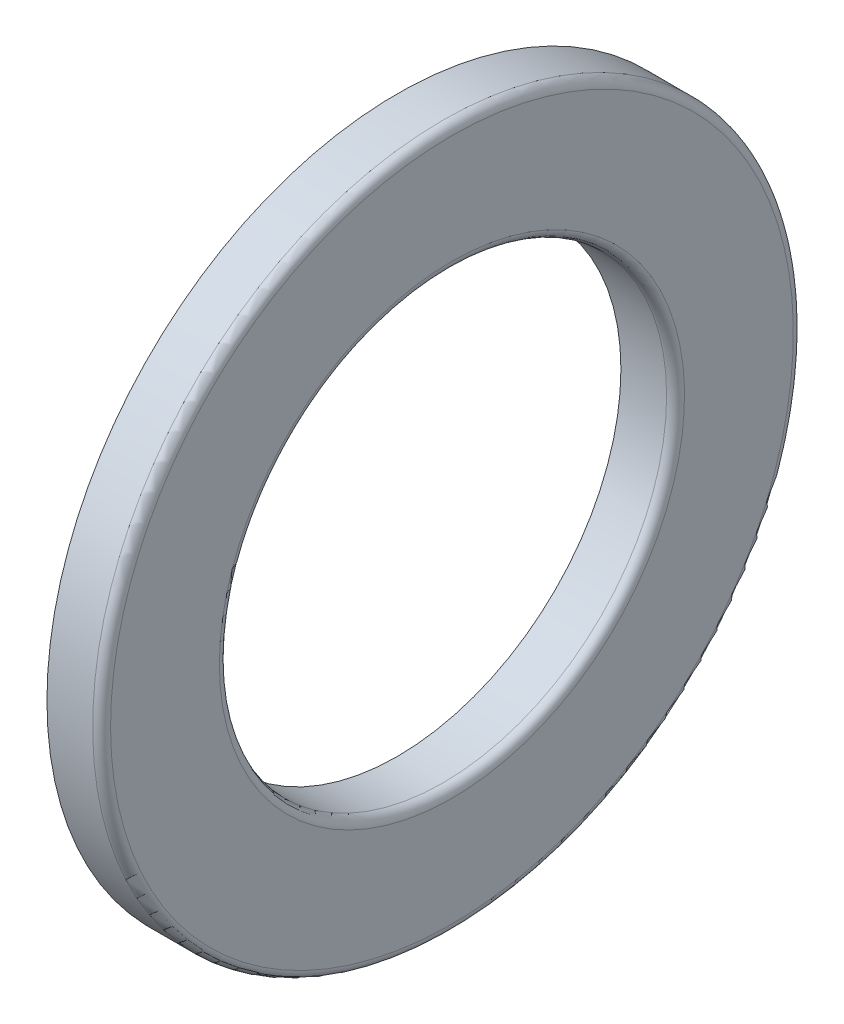
ISO-10303-21;
HEADER;
FILE_DESCRIPTION(('STEP AP214'),'2;1');
FILE_NAME('part.step','',(''),(''),'','','');
FILE_SCHEMA(('AUTOMOTIVE_DESIGN { 1 0 10303 214 1 1 1 1 }'));
ENDSEC;
DATA;
#1=APPLICATION_CONTEXT('core data for automotive mechanical design processes');
#2=APPLICATION_PROTOCOL_DEFINITION('international standard','automotive_design',2000,#1);
#3=PRODUCT_CONTEXT('',#1,'mechanical');
#4=PRODUCT('Part','Part','',(#3));
#5=PRODUCT_RELATED_PRODUCT_CATEGORY('part','',(#4));
#6=PRODUCT_DEFINITION_FORMATION('','',#4);
#7=PRODUCT_DEFINITION_CONTEXT('part definition',#1,'design');
#8=PRODUCT_DEFINITION('design','',#6,#7);
#9=PRODUCT_DEFINITION_SHAPE('','',#8);
#10=(LENGTH_UNIT() NAMED_UNIT(*) SI_UNIT(.MILLI.,.METRE.));
#11=(NAMED_UNIT(*) PLANE_ANGLE_UNIT() SI_UNIT($,.RADIAN.));
#12=(NAMED_UNIT(*) SI_UNIT($,.STERADIAN.) SOLID_ANGLE_UNIT());
#13=UNCERTAINTY_MEASURE_WITH_UNIT(LENGTH_MEASURE(1.E-05),#10,'distance_accuracy_value','');
#14=(GEOMETRIC_REPRESENTATION_CONTEXT(3) GLOBAL_UNCERTAINTY_ASSIGNED_CONTEXT((#13)) GLOBAL_UNIT_ASSIGNED_CONTEXT((#10,
#11,#12)) REPRESENTATION_CONTEXT('',''));
#15=CARTESIAN_POINT('',(0.,0.,0.));
#16=DIRECTION('',(0.,0.,1.));
#17=DIRECTION('',(1.,0.,0.));
#18=AXIS2_PLACEMENT_3D('',#15,#16,#17);
#19=CARTESIAN_POINT('',(5.5,0.,0.));
#20=DIRECTION('',(1.,0.,0.));
#21=DIRECTION('',(0.,1.,0.));
#22=AXIS2_PLACEMENT_3D('',#19,#20,#21);
#23=TOROIDAL_SURFACE('',#22,19.75,2.2);
#24=CARTESIAN_POINT('',(7.33333333333333,0.,0.));
#25=DIRECTION('',(1.,0.,0.));
#26=DIRECTION('',(0.,0.,-1.));
#27=AXIS2_PLACEMENT_3D('',#24,#25,#26);
#28=CIRCLE('',#27,18.5339042435364);
#29=CARTESIAN_POINT('',(7.33333333333333,0.,-18.5339042435364));
#30=VERTEX_POINT('',#29);
#31=EDGE_CURVE('E18',#30,#30,#28,.F.);
#32=ORIENTED_EDGE('',*,*,#31,.F.);
#33=EDGE_LOOP('',(#32));
#34=FACE_BOUND('',#33,.T.);
#35=CARTESIAN_POINT('',(7.33333333333333,0.,0.));
#36=DIRECTION('',(1.,0.,0.));
#37=DIRECTION('',(0.,0.,-1.));
#38=AXIS2_PLACEMENT_3D('',#35,#36,#37);
#39=CIRCLE('',#38,20.9660957564636);
#40=CARTESIAN_POINT('',(7.33333333333333,0.,-20.9660957564636));
#41=VERTEX_POINT('',#40);
#42=EDGE_CURVE('E52',#41,#41,#39,.T.);
#43=ORIENTED_EDGE('',*,*,#42,.F.);
#44=EDGE_LOOP('',(#43));
#45=FACE_BOUND('',#44,.T.);
#46=ADVANCED_FACE('F14',(#34,#45),#23,.F.);
#47=CARTESIAN_POINT('',(7.33333333333333,0.,19.25));
#48=DIRECTION('',(-1.,0.,0.));
#49=DIRECTION('',(0.,0.,1.));
#50=AXIS2_PLACEMENT_3D('',#47,#48,#49);
#51=PLANE('',#50);
#52=CARTESIAN_POINT('',(7.33333333333333,0.,0.));
#53=DIRECTION('',(1.,0.,0.));
#54=DIRECTION('',(0.,0.,-1.));
#55=AXIS2_PLACEMENT_3D('',#52,#53,#54);
#56=CIRCLE('',#55,15.00000000005);
#57=CARTESIAN_POINT('',(7.33333333333333,0.,-15.00000000005));
#58=VERTEX_POINT('',#57);
#59=EDGE_CURVE('E50',#58,#58,#56,.F.);
#60=ORIENTED_EDGE('',*,*,#59,.F.);
#61=EDGE_LOOP('',(#60));
#62=FACE_BOUND('',#61,.T.);
#63=ORIENTED_EDGE('',*,*,#31,.T.);
#64=EDGE_LOOP('',(#63));
#65=FACE_BOUND('',#64,.T.);
#66=ADVANCED_FACE('F59',(#62,#65),#51,.T.);
#67=CARTESIAN_POINT('',(7.33333333333333,0.,19.25));
#68=DIRECTION('',(-1.,0.,0.));
#69=DIRECTION('',(0.,0.,1.));
#70=AXIS2_PLACEMENT_3D('',#67,#68,#69);
#71=PLANE('',#70);
#72=CARTESIAN_POINT('',(7.33333333333333,0.,0.));
#73=DIRECTION('',(1.,0.,0.));
#74=DIRECTION('',(0.,0.,-1.));
#75=AXIS2_PLACEMENT_3D('',#72,#73,#74);
#76=CIRCLE('',#75,23.5);
#77=CARTESIAN_POINT('',(7.33333333333333,0.,-23.5));
#78=VERTEX_POINT('',#77);
#79=EDGE_CURVE('E37',#78,#78,#76,.T.);
#80=ORIENTED_EDGE('',*,*,#79,.F.);
#81=EDGE_LOOP('',(#80));
#82=FACE_BOUND('',#81,.T.);
#83=ORIENTED_EDGE('',*,*,#42,.T.);
#84=EDGE_LOOP('',(#83));
#85=FACE_BOUND('',#84,.T.);
#86=ADVANCED_FACE('F67',(#82,#85),#71,.T.);
#87=CARTESIAN_POINT('',(7.33333333333333,0.,0.));
#88=DIRECTION('',(1.,0.,0.));
#89=DIRECTION('',(0.,0.,-1.));
#90=AXIS2_PLACEMENT_3D('',#87,#88,#89);
#91=CYLINDRICAL_SURFACE('',#90,15.00000000005);
#92=ORIENTED_EDGE('',*,*,#59,.T.);
#93=EDGE_LOOP('',(#92));
#94=FACE_BOUND('',#93,.T.);
#95=CARTESIAN_POINT('',(10.4,0.,0.));
#96=DIRECTION('',(1.,0.,0.));
#97=DIRECTION('',(0.,1.,0.));
#98=AXIS2_PLACEMENT_3D('',#95,#96,#97);
#99=CIRCLE('',#98,15.0000000001);
#100=CARTESIAN_POINT('',(10.4,15.0000000001,0.));
#101=VERTEX_POINT('',#100);
#102=EDGE_CURVE('E32',#101,#101,#99,.F.);
#103=ORIENTED_EDGE('',*,*,#102,.F.);
#104=EDGE_LOOP('',(#103));
#105=FACE_BOUND('',#104,.T.);
#106=ADVANCED_FACE('F113',(#94,#105),#91,.F.);
#107=CARTESIAN_POINT('',(8.86666666666667,0.,0.));
#108=DIRECTION('',(1.,0.,0.));
#109=DIRECTION('',(0.,0.,-1.));
#110=AXIS2_PLACEMENT_3D('',#107,#108,#109);
#111=CYLINDRICAL_SURFACE('',#110,23.5);
#112=CARTESIAN_POINT('',(10.3999999997293,0.,0.));
#113=DIRECTION('',(1.,0.,0.));
#114=DIRECTION('',(0.,1.,0.));
#115=AXIS2_PLACEMENT_3D('',#112,#113,#114);
#116=CIRCLE('',#115,23.5);
#117=CARTESIAN_POINT('',(10.3999999997293,23.5,0.));
#118=VERTEX_POINT('',#117);
#119=EDGE_CURVE('E27',#118,#118,#116,.T.);
#120=ORIENTED_EDGE('',*,*,#119,.F.);
#121=EDGE_LOOP('',(#120));
#122=FACE_BOUND('',#121,.T.);
#123=ORIENTED_EDGE('',*,*,#79,.T.);
#124=EDGE_LOOP('',(#123));
#125=FACE_BOUND('',#124,.T.);
#126=ADVANCED_FACE('F109',(#122,#125),#111,.T.);
#127=CARTESIAN_POINT('',(10.3999999998293,0.,0.));
#128=DIRECTION('',(1.,0.,0.));
#129=DIRECTION('',(0.,1.,0.));
#130=AXIS2_PLACEMENT_3D('',#127,#128,#129);
#131=TOROIDAL_SURFACE('',#130,15.6000000002707,0.600000000170715);
#132=CARTESIAN_POINT('',(11.,0.,0.));
#133=DIRECTION('',(1.,0.,0.));
#134=DIRECTION('',(0.,0.,1.));
#135=AXIS2_PLACEMENT_3D('',#132,#133,#134);
#136=CIRCLE('',#135,15.6);
#137=CARTESIAN_POINT('',(11.,0.,15.6));
#138=VERTEX_POINT('',#137);
#139=EDGE_CURVE('E22',#138,#138,#136,.F.);
#140=ORIENTED_EDGE('',*,*,#139,.F.);
#141=EDGE_LOOP('',(#140));
#142=FACE_BOUND('',#141,.T.);
#143=ORIENTED_EDGE('',*,*,#102,.T.);
#144=EDGE_LOOP('',(#143));
#145=FACE_BOUND('',#144,.T.);
#146=ADVANCED_FACE('F76',(#142,#145),#131,.T.);
#147=CARTESIAN_POINT('',(10.3999999997293,0.,0.));
#148=DIRECTION('',(1.,0.,0.));
#149=DIRECTION('',(0.,1.,0.));
#150=AXIS2_PLACEMENT_3D('',#147,#148,#149);
#151=TOROIDAL_SURFACE('',#150,22.8999999998293,0.600000000170709);
#152=ORIENTED_EDGE('',*,*,#119,.T.);
#153=EDGE_LOOP('',(#152));
#154=FACE_BOUND('',#153,.T.);
#155=CARTESIAN_POINT('',(10.9999999999,0.,0.));
#156=DIRECTION('',(-1.,0.,0.));
#157=DIRECTION('',(0.,0.,1.));
#158=AXIS2_PLACEMENT_3D('',#155,#156,#157);
#159=CIRCLE('',#158,22.9);
#160=CARTESIAN_POINT('',(10.9999999999,0.,22.9));
#161=VERTEX_POINT('',#160);
#162=EDGE_CURVE('E10',#161,#161,#159,.F.);
#163=ORIENTED_EDGE('',*,*,#162,.F.);
#164=EDGE_LOOP('',(#163));
#165=FACE_BOUND('',#164,.T.);
#166=ADVANCED_FACE('F71',(#154,#165),#151,.T.);
#167=CARTESIAN_POINT('',(10.99999999995,0.,19.25));
#168=DIRECTION('',(1.,0.,0.));
#169=DIRECTION('',(0.,1.,0.));
#170=AXIS2_PLACEMENT_3D('',#167,#168,#169);
#171=PLANE('',#170);
#172=ORIENTED_EDGE('',*,*,#162,.T.);
#173=EDGE_LOOP('',(#172));
#174=FACE_BOUND('',#173,.T.);
#175=ORIENTED_EDGE('',*,*,#139,.T.);
#176=EDGE_LOOP('',(#175));
#177=FACE_BOUND('',#176,.T.);
#178=ADVANCED_FACE('F69',(#174,#177),#171,.T.);
#179=CLOSED_SHELL('',(#46,#66,#86,#106,#126,#146,#166,#178));
#180=MANIFOLD_SOLID_BREP('B1',#179);
#181=ADVANCED_BREP_SHAPE_REPRESENTATION('',(#18,#180),#14);
#182=SHAPE_DEFINITION_REPRESENTATION(#9,#181);
ENDSEC;
END-ISO-10303-21;
